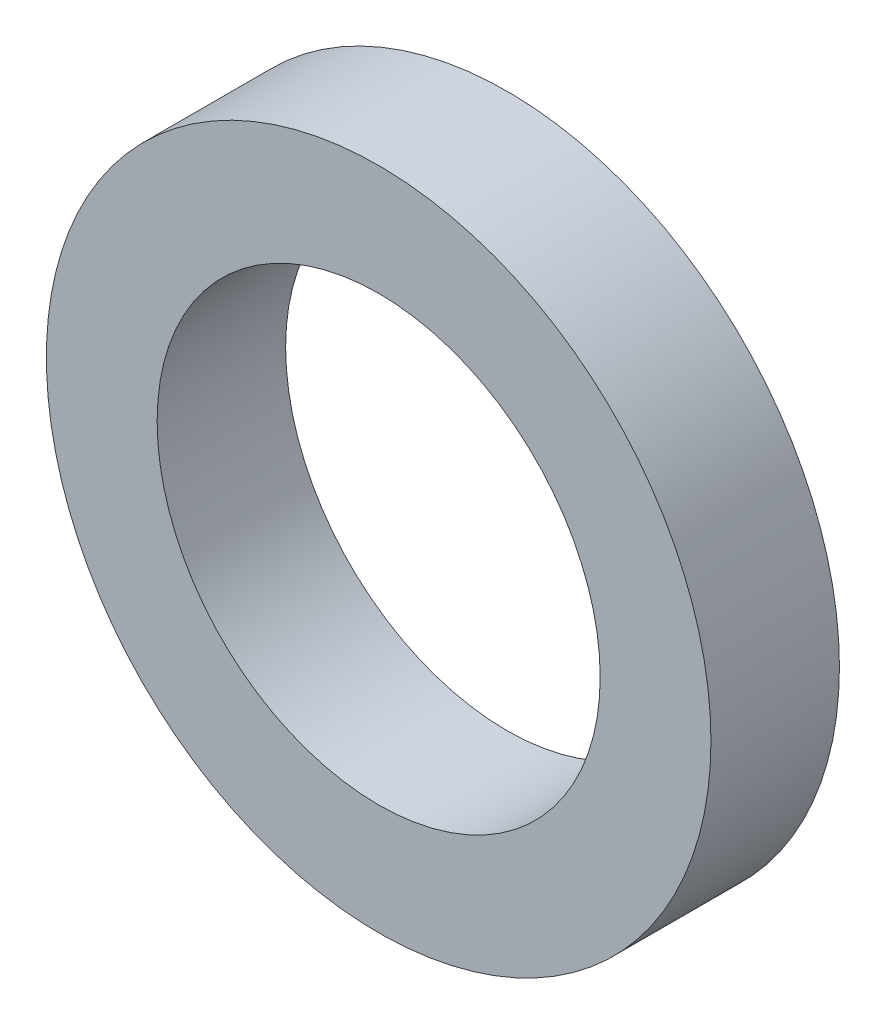
ISO-10303-21;
HEADER;
FILE_DESCRIPTION(('STEP AP214'),'2;1');
FILE_NAME('part.step','',(''),(''),'','','');
FILE_SCHEMA(('AUTOMOTIVE_DESIGN { 1 0 10303 214 1 1 1 1 }'));
ENDSEC;
DATA;
#1=APPLICATION_CONTEXT('core data for automotive mechanical design processes');
#2=APPLICATION_PROTOCOL_DEFINITION('international standard','automotive_design',2000,#1);
#3=PRODUCT_CONTEXT('',#1,'mechanical');
#4=PRODUCT('Part','Part','',(#3));
#5=PRODUCT_RELATED_PRODUCT_CATEGORY('part','',(#4));
#6=PRODUCT_DEFINITION_FORMATION('','',#4);
#7=PRODUCT_DEFINITION_CONTEXT('part definition',#1,'design');
#8=PRODUCT_DEFINITION('design','',#6,#7);
#9=PRODUCT_DEFINITION_SHAPE('','',#8);
#10=(LENGTH_UNIT() NAMED_UNIT(*) SI_UNIT(.MILLI.,.METRE.));
#11=(NAMED_UNIT(*) PLANE_ANGLE_UNIT() SI_UNIT($,.RADIAN.));
#12=(NAMED_UNIT(*) SI_UNIT($,.STERADIAN.) SOLID_ANGLE_UNIT());
#13=UNCERTAINTY_MEASURE_WITH_UNIT(LENGTH_MEASURE(1.E-05),#10,'distance_accuracy_value','');
#14=(GEOMETRIC_REPRESENTATION_CONTEXT(3) GLOBAL_UNCERTAINTY_ASSIGNED_CONTEXT((#13)) GLOBAL_UNIT_ASSIGNED_CONTEXT((#10,
#11,#12)) REPRESENTATION_CONTEXT('',''));
#15=CARTESIAN_POINT('',(0.,0.,0.));
#16=DIRECTION('',(0.,0.,1.));
#17=DIRECTION('',(1.,0.,0.));
#18=AXIS2_PLACEMENT_3D('',#15,#16,#17);
#19=CARTESIAN_POINT('',(0.,0.,3.683));
#20=DIRECTION('',(0.,0.,1.));
#21=DIRECTION('',(1.,0.,0.));
#22=AXIS2_PLACEMENT_3D('',#19,#20,#21);
#23=PLANE('',#22);
#24=CARTESIAN_POINT('',(0.,0.,3.683));
#25=DIRECTION('',(0.,0.,1.));
#26=DIRECTION('',(1.,0.,0.));
#27=AXIS2_PLACEMENT_3D('',#24,#25,#26);
#28=CIRCLE('',#27,9.525);
#29=CARTESIAN_POINT('',(9.525,0.,3.683));
#30=VERTEX_POINT('',#29);
#31=EDGE_CURVE('E10',#30,#30,#28,.T.);
#32=ORIENTED_EDGE('',*,*,#31,.T.);
#33=EDGE_LOOP('',(#32));
#34=FACE_BOUND('',#33,.T.);
#35=CARTESIAN_POINT('',(0.,0.,3.683));
#36=DIRECTION('',(0.,0.,1.));
#37=DIRECTION('',(1.,0.,0.));
#38=AXIS2_PLACEMENT_3D('',#35,#36,#37);
#39=CIRCLE('',#38,6.35);
#40=CARTESIAN_POINT('',(6.35,0.,3.683));
#41=VERTEX_POINT('',#40);
#42=EDGE_CURVE('E42',#41,#41,#39,.T.);
#43=ORIENTED_EDGE('',*,*,#42,.F.);
#44=EDGE_LOOP('',(#43));
#45=FACE_BOUND('',#44,.T.);
#46=ADVANCED_FACE('F31',(#34,#45),#23,.T.);
#47=CARTESIAN_POINT('',(0.,0.,0.));
#48=DIRECTION('',(0.,0.,1.));
#49=DIRECTION('',(1.,0.,0.));
#50=AXIS2_PLACEMENT_3D('',#47,#48,#49);
#51=PLANE('',#50);
#52=CARTESIAN_POINT('',(0.,0.,0.));
#53=DIRECTION('',(0.,0.,1.));
#54=DIRECTION('',(1.,0.,0.));
#55=AXIS2_PLACEMENT_3D('',#52,#53,#54);
#56=CIRCLE('',#55,9.525);
#57=CARTESIAN_POINT('',(9.525,0.,0.));
#58=VERTEX_POINT('',#57);
#59=EDGE_CURVE('E35',#58,#58,#56,.T.);
#60=ORIENTED_EDGE('',*,*,#59,.F.);
#61=EDGE_LOOP('',(#60));
#62=FACE_BOUND('',#61,.T.);
#63=CARTESIAN_POINT('',(0.,0.,0.));
#64=DIRECTION('',(0.,0.,1.));
#65=DIRECTION('',(1.,0.,0.));
#66=AXIS2_PLACEMENT_3D('',#63,#64,#65);
#67=CIRCLE('',#66,6.35);
#68=CARTESIAN_POINT('',(6.35,0.,0.));
#69=VERTEX_POINT('',#68);
#70=EDGE_CURVE('E44',#69,#69,#67,.T.);
#71=ORIENTED_EDGE('',*,*,#70,.T.);
#72=EDGE_LOOP('',(#71));
#73=FACE_BOUND('',#72,.T.);
#74=ADVANCED_FACE('F54',(#62,#73),#51,.F.);
#75=CARTESIAN_POINT('',(0.,0.,3.683));
#76=DIRECTION('',(0.,0.,-1.));
#77=DIRECTION('',(-1.,0.,0.));
#78=AXIS2_PLACEMENT_3D('',#75,#76,#77);
#79=CYLINDRICAL_SURFACE('',#78,9.525);
#80=ORIENTED_EDGE('',*,*,#31,.F.);
#81=EDGE_LOOP('',(#80));
#82=FACE_BOUND('',#81,.T.);
#83=ORIENTED_EDGE('',*,*,#59,.T.);
#84=EDGE_LOOP('',(#83));
#85=FACE_BOUND('',#84,.T.);
#86=ADVANCED_FACE('F33',(#82,#85),#79,.T.);
#87=CARTESIAN_POINT('',(0.,0.,3.683));
#88=DIRECTION('',(0.,0.,-1.));
#89=DIRECTION('',(-1.,0.,0.));
#90=AXIS2_PLACEMENT_3D('',#87,#88,#89);
#91=CYLINDRICAL_SURFACE('',#90,6.35);
#92=ORIENTED_EDGE('',*,*,#42,.T.);
#93=EDGE_LOOP('',(#92));
#94=FACE_BOUND('',#93,.T.);
#95=ORIENTED_EDGE('',*,*,#70,.F.);
#96=EDGE_LOOP('',(#95));
#97=FACE_BOUND('',#96,.T.);
#98=ADVANCED_FACE('F50',(#94,#97),#91,.F.);
#99=CLOSED_SHELL('',(#46,#74,#86,#98));
#100=MANIFOLD_SOLID_BREP('B2',#99);
#101=ADVANCED_BREP_SHAPE_REPRESENTATION('',(#18,#100),#14);
#102=SHAPE_DEFINITION_REPRESENTATION(#9,#101);
ENDSEC;
END-ISO-10303-21;
